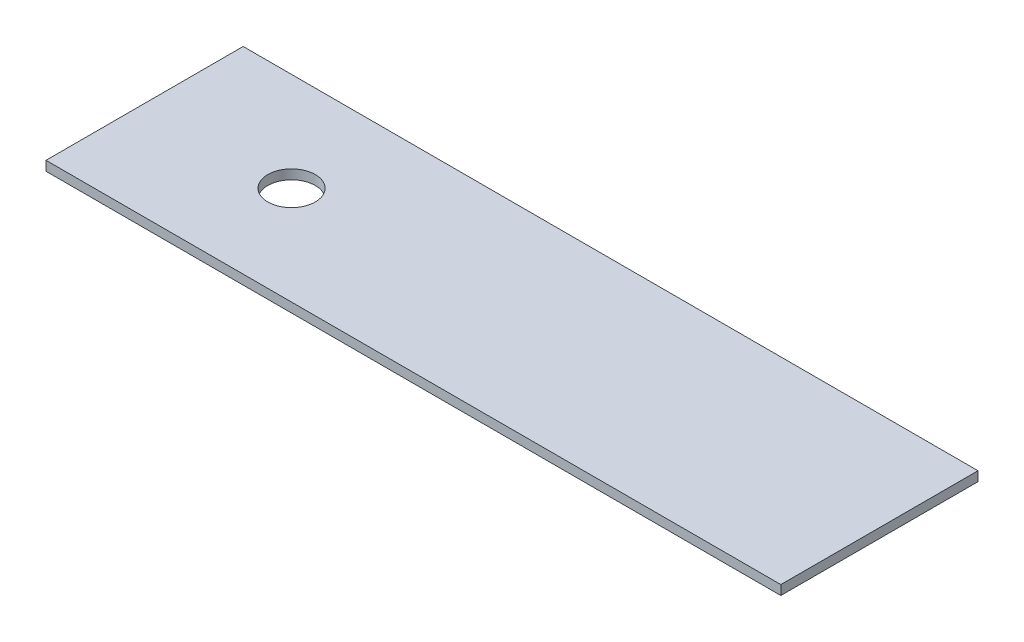
ISO-10303-21;
HEADER;
FILE_DESCRIPTION(('STEP AP214'),'2;1');
FILE_NAME('part.step','',(''),(''),'','','');
FILE_SCHEMA(('AUTOMOTIVE_DESIGN { 1 0 10303 214 1 1 1 1 }'));
ENDSEC;
DATA;
#1=APPLICATION_CONTEXT('core data for automotive mechanical design processes');
#2=APPLICATION_PROTOCOL_DEFINITION('international standard','automotive_design',2000,#1);
#3=PRODUCT_CONTEXT('',#1,'mechanical');
#4=PRODUCT('Part','Part','',(#3));
#5=PRODUCT_RELATED_PRODUCT_CATEGORY('part','',(#4));
#6=PRODUCT_DEFINITION_FORMATION('','',#4);
#7=PRODUCT_DEFINITION_CONTEXT('part definition',#1,'design');
#8=PRODUCT_DEFINITION('design','',#6,#7);
#9=PRODUCT_DEFINITION_SHAPE('','',#8);
#10=(LENGTH_UNIT() NAMED_UNIT(*) SI_UNIT(.MILLI.,.METRE.));
#11=(NAMED_UNIT(*) PLANE_ANGLE_UNIT() SI_UNIT($,.RADIAN.));
#12=(NAMED_UNIT(*) SI_UNIT($,.STERADIAN.) SOLID_ANGLE_UNIT());
#13=UNCERTAINTY_MEASURE_WITH_UNIT(LENGTH_MEASURE(1.E-05),#10,'distance_accuracy_value','');
#14=(GEOMETRIC_REPRESENTATION_CONTEXT(3) GLOBAL_UNCERTAINTY_ASSIGNED_CONTEXT((#13)) GLOBAL_UNIT_ASSIGNED_CONTEXT((#10,
#11,#12)) REPRESENTATION_CONTEXT('',''));
#15=CARTESIAN_POINT('',(0.,0.,0.));
#16=DIRECTION('',(0.,0.,1.));
#17=DIRECTION('',(1.,0.,0.));
#18=AXIS2_PLACEMENT_3D('',#15,#16,#17);
#19=CARTESIAN_POINT('',(0.,6.,0.));
#20=DIRECTION('',(0.,1.,0.));
#21=DIRECTION('',(0.,0.,1.));
#22=AXIS2_PLACEMENT_3D('',#19,#20,#21);
#23=PLANE('',#22);
#24=DIRECTION('',(0.,0.,1.));
#25=VECTOR('',#24,1.);
#26=CARTESIAN_POINT('',(-232.,6.,62.25));
#27=LINE('',#26,#25);
#28=CARTESIAN_POINT('',(-232.,6.,-62.25));
#29=VERTEX_POINT('',#28);
#30=CARTESIAN_POINT('',(-232.,6.,62.25));
#31=VERTEX_POINT('',#30);
#32=EDGE_CURVE('E89',#29,#31,#27,.T.);
#33=ORIENTED_EDGE('',*,*,#32,.T.);
#34=DIRECTION('',(1.,0.,0.));
#35=VECTOR('',#34,1.);
#36=CARTESIAN_POINT('',(232.,6.,62.25));
#37=LINE('',#36,#35);
#38=CARTESIAN_POINT('',(232.,6.,62.25));
#39=VERTEX_POINT('',#38);
#40=EDGE_CURVE('E84',#31,#39,#37,.T.);
#41=ORIENTED_EDGE('',*,*,#40,.T.);
#42=DIRECTION('',(0.,0.,-1.));
#43=VECTOR('',#42,1.);
#44=CARTESIAN_POINT('',(232.,6.,62.25));
#45=LINE('',#44,#43);
#46=CARTESIAN_POINT('',(232.,6.,-62.25));
#47=VERTEX_POINT('',#46);
#48=EDGE_CURVE('E87',#39,#47,#45,.T.);
#49=ORIENTED_EDGE('',*,*,#48,.T.);
#50=DIRECTION('',(-1.,0.,0.));
#51=VECTOR('',#50,1.);
#52=CARTESIAN_POINT('',(232.,6.,-62.25));
#53=LINE('',#52,#51);
#54=EDGE_CURVE('E54',#47,#29,#53,.T.);
#55=ORIENTED_EDGE('',*,*,#54,.T.);
#56=EDGE_LOOP('',(#33,#41,#49,#55));
#57=FACE_BOUND('',#56,.T.);
#58=CARTESIAN_POINT('',(-139.2,6.,0.));
#59=DIRECTION('',(0.,1.,0.));
#60=DIRECTION('',(0.,0.,1.));
#61=AXIS2_PLACEMENT_3D('',#58,#59,#60);
#62=CIRCLE('',#61,15.);
#63=CARTESIAN_POINT('',(-139.2,6.,15.));
#64=VERTEX_POINT('',#63);
#65=EDGE_CURVE('E104',#64,#64,#62,.T.);
#66=ORIENTED_EDGE('',*,*,#65,.F.);
#67=EDGE_LOOP('',(#66));
#68=FACE_BOUND('',#67,.T.);
#69=ADVANCED_FACE('F37',(#57,#68),#23,.T.);
#70=CARTESIAN_POINT('',(0.,0.,0.));
#71=DIRECTION('',(0.,1.,0.));
#72=DIRECTION('',(0.,0.,1.));
#73=AXIS2_PLACEMENT_3D('',#70,#71,#72);
#74=PLANE('',#73);
#75=DIRECTION('',(0.,0.,1.));
#76=VECTOR('',#75,1.);
#77=CARTESIAN_POINT('',(-232.,0.,62.25));
#78=LINE('',#77,#76);
#79=CARTESIAN_POINT('',(-232.,0.,-62.25));
#80=VERTEX_POINT('',#79);
#81=CARTESIAN_POINT('',(-232.,0.,62.25));
#82=VERTEX_POINT('',#81);
#83=EDGE_CURVE('E101',#80,#82,#78,.T.);
#84=ORIENTED_EDGE('',*,*,#83,.F.);
#85=DIRECTION('',(-1.,0.,0.));
#86=VECTOR('',#85,1.);
#87=CARTESIAN_POINT('',(232.,0.,-62.25));
#88=LINE('',#87,#86);
#89=CARTESIAN_POINT('',(232.,0.,-62.25));
#90=VERTEX_POINT('',#89);
#91=EDGE_CURVE('E77',#90,#80,#88,.T.);
#92=ORIENTED_EDGE('',*,*,#91,.F.);
#93=DIRECTION('',(0.,0.,-1.));
#94=VECTOR('',#93,1.);
#95=CARTESIAN_POINT('',(232.,0.,62.25));
#96=LINE('',#95,#94);
#97=CARTESIAN_POINT('',(232.,0.,62.25));
#98=VERTEX_POINT('',#97);
#99=EDGE_CURVE('E71',#98,#90,#96,.T.);
#100=ORIENTED_EDGE('',*,*,#99,.F.);
#101=DIRECTION('',(1.,0.,0.));
#102=VECTOR('',#101,1.);
#103=CARTESIAN_POINT('',(232.,0.,62.25));
#104=LINE('',#103,#102);
#105=EDGE_CURVE('E93',#82,#98,#104,.T.);
#106=ORIENTED_EDGE('',*,*,#105,.F.);
#107=EDGE_LOOP('',(#84,#92,#100,#106));
#108=FACE_BOUND('',#107,.T.);
#109=CARTESIAN_POINT('',(-139.2,0.,0.));
#110=DIRECTION('',(0.,1.,0.));
#111=DIRECTION('',(0.,0.,1.));
#112=AXIS2_PLACEMENT_3D('',#109,#110,#111);
#113=CIRCLE('',#112,15.);
#114=CARTESIAN_POINT('',(-139.2,0.,15.));
#115=VERTEX_POINT('',#114);
#116=EDGE_CURVE('E116',#115,#115,#113,.T.);
#117=ORIENTED_EDGE('',*,*,#116,.T.);
#118=EDGE_LOOP('',(#117));
#119=FACE_BOUND('',#118,.T.);
#120=ADVANCED_FACE('F112',(#108,#119),#74,.F.);
#121=CARTESIAN_POINT('',(-232.,6.,62.25));
#122=DIRECTION('',(1.,0.,0.));
#123=DIRECTION('',(0.,0.,-1.));
#124=AXIS2_PLACEMENT_3D('',#121,#122,#123);
#125=PLANE('',#124);
#126=ORIENTED_EDGE('',*,*,#83,.T.);
#127=DIRECTION('',(0.,-1.,0.));
#128=VECTOR('',#127,1.);
#129=CARTESIAN_POINT('',(-232.,6.,62.25));
#130=LINE('',#129,#128);
#131=EDGE_CURVE('E11',#31,#82,#130,.T.);
#132=ORIENTED_EDGE('',*,*,#131,.F.);
#133=ORIENTED_EDGE('',*,*,#32,.F.);
#134=DIRECTION('',(0.,-1.,0.));
#135=VECTOR('',#134,1.);
#136=CARTESIAN_POINT('',(-232.,6.,-62.25));
#137=LINE('',#136,#135);
#138=EDGE_CURVE('E97',#29,#80,#137,.T.);
#139=ORIENTED_EDGE('',*,*,#138,.T.);
#140=EDGE_LOOP('',(#126,#132,#133,#139));
#141=FACE_BOUND('',#140,.T.);
#142=ADVANCED_FACE('F39',(#141),#125,.F.);
#143=CARTESIAN_POINT('',(232.,6.,62.25));
#144=DIRECTION('',(0.,0.,-1.));
#145=DIRECTION('',(-1.,0.,0.));
#146=AXIS2_PLACEMENT_3D('',#143,#144,#145);
#147=PLANE('',#146);
#148=ORIENTED_EDGE('',*,*,#105,.T.);
#149=DIRECTION('',(0.,-1.,0.));
#150=VECTOR('',#149,1.);
#151=CARTESIAN_POINT('',(232.,6.,62.25));
#152=LINE('',#151,#150);
#153=EDGE_CURVE('E46',#39,#98,#152,.T.);
#154=ORIENTED_EDGE('',*,*,#153,.F.);
#155=ORIENTED_EDGE('',*,*,#40,.F.);
#156=ORIENTED_EDGE('',*,*,#131,.T.);
#157=EDGE_LOOP('',(#148,#154,#155,#156));
#158=FACE_BOUND('',#157,.T.);
#159=ADVANCED_FACE('F92',(#158),#147,.F.);
#160=CARTESIAN_POINT('',(232.,6.,62.25));
#161=DIRECTION('',(-1.,0.,0.));
#162=DIRECTION('',(0.,0.,1.));
#163=AXIS2_PLACEMENT_3D('',#160,#161,#162);
#164=PLANE('',#163);
#165=ORIENTED_EDGE('',*,*,#99,.T.);
#166=DIRECTION('',(0.,-1.,0.));
#167=VECTOR('',#166,1.);
#168=CARTESIAN_POINT('',(232.,6.,-62.25));
#169=LINE('',#168,#167);
#170=EDGE_CURVE('E94',#47,#90,#169,.T.);
#171=ORIENTED_EDGE('',*,*,#170,.F.);
#172=ORIENTED_EDGE('',*,*,#48,.F.);
#173=ORIENTED_EDGE('',*,*,#153,.T.);
#174=EDGE_LOOP('',(#165,#171,#172,#173));
#175=FACE_BOUND('',#174,.T.);
#176=ADVANCED_FACE('F95',(#175),#164,.F.);
#177=CARTESIAN_POINT('',(232.,6.,-62.25));
#178=DIRECTION('',(0.,0.,1.));
#179=DIRECTION('',(1.,0.,0.));
#180=AXIS2_PLACEMENT_3D('',#177,#178,#179);
#181=PLANE('',#180);
#182=ORIENTED_EDGE('',*,*,#91,.T.);
#183=ORIENTED_EDGE('',*,*,#138,.F.);
#184=ORIENTED_EDGE('',*,*,#54,.F.);
#185=ORIENTED_EDGE('',*,*,#170,.T.);
#186=EDGE_LOOP('',(#182,#183,#184,#185));
#187=FACE_BOUND('',#186,.T.);
#188=ADVANCED_FACE('F109',(#187),#181,.F.);
#189=CARTESIAN_POINT('',(-139.2,6.,0.));
#190=DIRECTION('',(0.,-1.,0.));
#191=DIRECTION('',(0.,0.,-1.));
#192=AXIS2_PLACEMENT_3D('',#189,#190,#191);
#193=CYLINDRICAL_SURFACE('',#192,15.);
#194=ORIENTED_EDGE('',*,*,#65,.T.);
#195=EDGE_LOOP('',(#194));
#196=FACE_BOUND('',#195,.T.);
#197=ORIENTED_EDGE('',*,*,#116,.F.);
#198=EDGE_LOOP('',(#197));
#199=FACE_BOUND('',#198,.T.);
#200=ADVANCED_FACE('F122',(#196,#199),#193,.F.);
#201=CLOSED_SHELL('',(#69,#120,#142,#159,#176,#188,#200));
#202=MANIFOLD_SOLID_BREP('B2',#201);
#203=ADVANCED_BREP_SHAPE_REPRESENTATION('',(#18,#202),#14);
#204=SHAPE_DEFINITION_REPRESENTATION(#9,#203);
ENDSEC;
END-ISO-10303-21;
